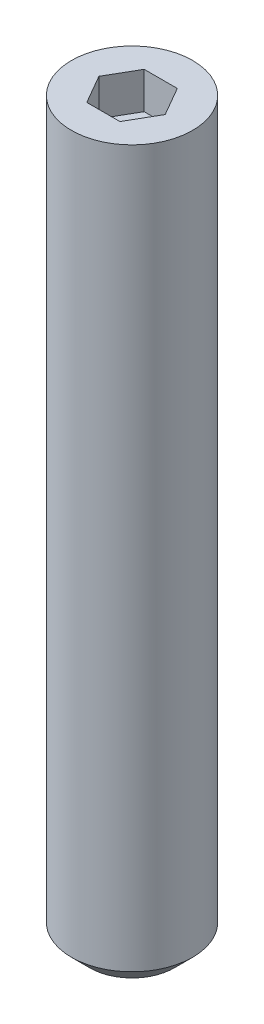
ISO-10303-21;
HEADER;
FILE_DESCRIPTION(('STEP AP214'),'2;1');
FILE_NAME('part.step','',(''),(''),'','','');
FILE_SCHEMA(('AUTOMOTIVE_DESIGN { 1 0 10303 214 1 1 1 1 }'));
ENDSEC;
DATA;
#1=APPLICATION_CONTEXT('core data for automotive mechanical design processes');
#2=APPLICATION_PROTOCOL_DEFINITION('international standard','automotive_design',2000,#1);
#3=PRODUCT_CONTEXT('',#1,'mechanical');
#4=PRODUCT('Part','Part','',(#3));
#5=PRODUCT_RELATED_PRODUCT_CATEGORY('part','',(#4));
#6=PRODUCT_DEFINITION_FORMATION('','',#4);
#7=PRODUCT_DEFINITION_CONTEXT('part definition',#1,'design');
#8=PRODUCT_DEFINITION('design','',#6,#7);
#9=PRODUCT_DEFINITION_SHAPE('','',#8);
#10=(LENGTH_UNIT() NAMED_UNIT(*) SI_UNIT(.MILLI.,.METRE.));
#11=(NAMED_UNIT(*) PLANE_ANGLE_UNIT() SI_UNIT($,.RADIAN.));
#12=(NAMED_UNIT(*) SI_UNIT($,.STERADIAN.) SOLID_ANGLE_UNIT());
#13=UNCERTAINTY_MEASURE_WITH_UNIT(LENGTH_MEASURE(1.E-05),#10,'distance_accuracy_value','');
#14=(GEOMETRIC_REPRESENTATION_CONTEXT(3) GLOBAL_UNCERTAINTY_ASSIGNED_CONTEXT((#13)) GLOBAL_UNIT_ASSIGNED_CONTEXT((#10,
#11,#12)) REPRESENTATION_CONTEXT('',''));
#15=CARTESIAN_POINT('',(0.,0.,0.));
#16=DIRECTION('',(0.,0.,1.));
#17=DIRECTION('',(1.,0.,0.));
#18=AXIS2_PLACEMENT_3D('',#15,#16,#17);
#19=CARTESIAN_POINT('',(-1.14567944042316,11.43,0.));
#20=DIRECTION('',(0.,1.,0.));
#21=DIRECTION('',(0.,0.,1.));
#22=AXIS2_PLACEMENT_3D('',#19,#20,#21);
#23=PLANE('',#22);
#24=DIRECTION('',(-0.5,0.,-0.866025403784438));
#25=VECTOR('',#24,1.);
#26=CARTESIAN_POINT('',(1.14567944042316,11.43,0.));
#27=LINE('',#26,#25);
#28=CARTESIAN_POINT('',(1.14567944042316,11.43,0.));
#29=VERTEX_POINT('',#28);
#30=CARTESIAN_POINT('',(0.572839720211582,11.43,-0.992187499999999));
#31=VERTEX_POINT('',#30);
#32=EDGE_CURVE('E67',#29,#31,#27,.T.);
#33=ORIENTED_EDGE('',*,*,#32,.T.);
#34=DIRECTION('',(-1.,0.,0.));
#35=VECTOR('',#34,1.);
#36=CARTESIAN_POINT('',(0.572839720211582,11.43,-0.992187499999999));
#37=LINE('',#36,#35);
#38=CARTESIAN_POINT('',(-0.572839720211583,11.43,-0.992187499999999));
#39=VERTEX_POINT('',#38);
#40=EDGE_CURVE('E69',#31,#39,#37,.T.);
#41=ORIENTED_EDGE('',*,*,#40,.T.);
#42=DIRECTION('',(-0.5,0.,0.866025403784439));
#43=VECTOR('',#42,1.);
#44=CARTESIAN_POINT('',(-0.572839720211583,11.43,-0.992187499999999));
#45=LINE('',#44,#43);
#46=CARTESIAN_POINT('',(-1.14567944042316,11.43,0.));
#47=VERTEX_POINT('',#46);
#48=EDGE_CURVE('E71',#39,#47,#45,.T.);
#49=ORIENTED_EDGE('',*,*,#48,.T.);
#50=DIRECTION('',(0.500000000000001,0.,0.866025403784438));
#51=VECTOR('',#50,1.);
#52=CARTESIAN_POINT('',(-1.14567944042316,11.43,0.));
#53=LINE('',#52,#51);
#54=CARTESIAN_POINT('',(-0.572839720211581,11.43,0.9921875));
#55=VERTEX_POINT('',#54);
#56=EDGE_CURVE('E117',#47,#55,#53,.T.);
#57=ORIENTED_EDGE('',*,*,#56,.T.);
#58=DIRECTION('',(1.,0.,0.));
#59=VECTOR('',#58,1.);
#60=CARTESIAN_POINT('',(-0.572839720211581,11.43,0.9921875));
#61=LINE('',#60,#59);
#62=CARTESIAN_POINT('',(0.572839720211582,11.43,0.9921875));
#63=VERTEX_POINT('',#62);
#64=EDGE_CURVE('E122',#55,#63,#61,.T.);
#65=ORIENTED_EDGE('',*,*,#64,.T.);
#66=DIRECTION('',(0.5,0.,-0.866025403784439));
#67=VECTOR('',#66,1.);
#68=CARTESIAN_POINT('',(0.572839720211582,11.43,0.9921875));
#69=LINE('',#68,#67);
#70=EDGE_CURVE('E126',#63,#29,#69,.T.);
#71=ORIENTED_EDGE('',*,*,#70,.T.);
#72=EDGE_LOOP('',(#33,#41,#49,#57,#65,#71));
#73=FACE_BOUND('',#72,.T.);
#74=ADVANCED_FACE('F16',(#73),#23,.T.);
#75=CARTESIAN_POINT('',(-0.572839720211583,11.43,-0.992187499999999));
#76=DIRECTION('',(-0.866025403784439,0.,-0.5));
#77=DIRECTION('',(-0.5,0.,0.866025403784439));
#78=AXIS2_PLACEMENT_3D('',#75,#76,#77);
#79=PLANE('',#78);
#80=DIRECTION('',(0.,1.,0.));
#81=VECTOR('',#80,1.);
#82=CARTESIAN_POINT('',(-1.14567944042316,11.43,0.));
#83=LINE('',#82,#81);
#84=CARTESIAN_POINT('',(-1.14567944042316,12.7,0.));
#85=VERTEX_POINT('',#84);
#86=EDGE_CURVE('E82',#85,#47,#83,.F.);
#87=ORIENTED_EDGE('',*,*,#86,.T.);
#88=ORIENTED_EDGE('',*,*,#48,.F.);
#89=DIRECTION('',(0.,1.,0.));
#90=VECTOR('',#89,1.);
#91=CARTESIAN_POINT('',(-0.572839720211583,11.43,-0.992187499999999));
#92=LINE('',#91,#90);
#93=CARTESIAN_POINT('',(-0.572839720211583,12.7,-0.992187499999999));
#94=VERTEX_POINT('',#93);
#95=EDGE_CURVE('E76',#39,#94,#92,.T.);
#96=ORIENTED_EDGE('',*,*,#95,.T.);
#97=DIRECTION('',(0.5,0.,-0.866025403784439));
#98=VECTOR('',#97,1.);
#99=CARTESIAN_POINT('',(-1.14567944042316,12.7,0.));
#100=LINE('',#99,#98);
#101=EDGE_CURVE('E114',#85,#94,#100,.T.);
#102=ORIENTED_EDGE('',*,*,#101,.F.);
#103=EDGE_LOOP('',(#87,#88,#96,#102));
#104=FACE_BOUND('',#103,.T.);
#105=ADVANCED_FACE('F79',(#104),#79,.F.);
#106=CARTESIAN_POINT('',(0.572839720211582,11.43,-0.992187499999999));
#107=DIRECTION('',(0.,0.,-1.));
#108=DIRECTION('',(-1.,0.,0.));
#109=AXIS2_PLACEMENT_3D('',#106,#107,#108);
#110=PLANE('',#109);
#111=ORIENTED_EDGE('',*,*,#95,.F.);
#112=ORIENTED_EDGE('',*,*,#40,.F.);
#113=DIRECTION('',(0.,1.,0.));
#114=VECTOR('',#113,1.);
#115=CARTESIAN_POINT('',(0.572839720211582,11.43,-0.992187499999999));
#116=LINE('',#115,#114);
#117=CARTESIAN_POINT('',(0.572839720211582,12.7,-0.992187499999999));
#118=VERTEX_POINT('',#117);
#119=EDGE_CURVE('E90',#31,#118,#116,.T.);
#120=ORIENTED_EDGE('',*,*,#119,.T.);
#121=DIRECTION('',(1.,0.,0.));
#122=VECTOR('',#121,1.);
#123=CARTESIAN_POINT('',(0.,12.7,-0.992187499999999));
#124=LINE('',#123,#122);
#125=EDGE_CURVE('E87',#94,#118,#124,.T.);
#126=ORIENTED_EDGE('',*,*,#125,.F.);
#127=EDGE_LOOP('',(#111,#112,#120,#126));
#128=FACE_BOUND('',#127,.T.);
#129=ADVANCED_FACE('F85',(#128),#110,.F.);
#130=CARTESIAN_POINT('',(1.14567944042316,11.43,0.));
#131=DIRECTION('',(0.866025403784438,0.,-0.5));
#132=DIRECTION('',(-0.5,0.,-0.866025403784438));
#133=AXIS2_PLACEMENT_3D('',#130,#131,#132);
#134=PLANE('',#133);
#135=ORIENTED_EDGE('',*,*,#119,.F.);
#136=ORIENTED_EDGE('',*,*,#32,.F.);
#137=DIRECTION('',(0.,1.,0.));
#138=VECTOR('',#137,1.);
#139=CARTESIAN_POINT('',(1.14567944042316,11.43,0.));
#140=LINE('',#139,#138);
#141=CARTESIAN_POINT('',(1.14567944042316,12.7,0.));
#142=VERTEX_POINT('',#141);
#143=EDGE_CURVE('E124',#29,#142,#140,.T.);
#144=ORIENTED_EDGE('',*,*,#143,.T.);
#145=DIRECTION('',(0.5,0.,0.866025403784438));
#146=VECTOR('',#145,1.);
#147=CARTESIAN_POINT('',(0.572839720211582,12.7,-0.992187499999999));
#148=LINE('',#147,#146);
#149=EDGE_CURVE('E110',#118,#142,#148,.T.);
#150=ORIENTED_EDGE('',*,*,#149,.F.);
#151=EDGE_LOOP('',(#135,#136,#144,#150));
#152=FACE_BOUND('',#151,.T.);
#153=ADVANCED_FACE('F129',(#152),#134,.F.);
#154=CARTESIAN_POINT('',(0.572839720211582,11.43,0.9921875));
#155=DIRECTION('',(0.866025403784439,0.,0.5));
#156=DIRECTION('',(0.5,0.,-0.866025403784439));
#157=AXIS2_PLACEMENT_3D('',#154,#155,#156);
#158=PLANE('',#157);
#159=ORIENTED_EDGE('',*,*,#143,.F.);
#160=ORIENTED_EDGE('',*,*,#70,.F.);
#161=DIRECTION('',(0.,1.,0.));
#162=VECTOR('',#161,1.);
#163=CARTESIAN_POINT('',(0.572839720211582,11.43,0.9921875));
#164=LINE('',#163,#162);
#165=CARTESIAN_POINT('',(0.572839720211582,12.7,0.9921875));
#166=VERTEX_POINT('',#165);
#167=EDGE_CURVE('E120',#63,#166,#164,.T.);
#168=ORIENTED_EDGE('',*,*,#167,.T.);
#169=DIRECTION('',(-0.5,0.,0.866025403784438));
#170=VECTOR('',#169,1.);
#171=CARTESIAN_POINT('',(1.14567944042316,12.7,0.));
#172=LINE('',#171,#170);
#173=EDGE_CURVE('E105',#142,#166,#172,.T.);
#174=ORIENTED_EDGE('',*,*,#173,.F.);
#175=EDGE_LOOP('',(#159,#160,#168,#174));
#176=FACE_BOUND('',#175,.T.);
#177=ADVANCED_FACE('F139',(#176),#158,.F.);
#178=CARTESIAN_POINT('',(-0.572839720211581,11.43,0.9921875));
#179=DIRECTION('',(0.,0.,1.));
#180=DIRECTION('',(1.,0.,0.));
#181=AXIS2_PLACEMENT_3D('',#178,#179,#180);
#182=PLANE('',#181);
#183=ORIENTED_EDGE('',*,*,#167,.F.);
#184=ORIENTED_EDGE('',*,*,#64,.F.);
#185=DIRECTION('',(0.,1.,0.));
#186=VECTOR('',#185,1.);
#187=CARTESIAN_POINT('',(-0.572839720211581,11.43,0.9921875));
#188=LINE('',#187,#186);
#189=CARTESIAN_POINT('',(-0.572839720211581,12.7,0.9921875));
#190=VERTEX_POINT('',#189);
#191=EDGE_CURVE('E34',#55,#190,#188,.T.);
#192=ORIENTED_EDGE('',*,*,#191,.T.);
#193=DIRECTION('',(1.,0.,0.));
#194=VECTOR('',#193,1.);
#195=CARTESIAN_POINT('',(0.,12.7,0.9921875));
#196=LINE('',#195,#194);
#197=EDGE_CURVE('E101',#166,#190,#196,.F.);
#198=ORIENTED_EDGE('',*,*,#197,.F.);
#199=EDGE_LOOP('',(#183,#184,#192,#198));
#200=FACE_BOUND('',#199,.T.);
#201=ADVANCED_FACE('F137',(#200),#182,.F.);
#202=CARTESIAN_POINT('',(-1.14567944042316,11.43,0.));
#203=DIRECTION('',(-0.866025403784438,0.,0.500000000000001));
#204=DIRECTION('',(0.500000000000001,0.,0.866025403784438));
#205=AXIS2_PLACEMENT_3D('',#202,#203,#204);
#206=PLANE('',#205);
#207=ORIENTED_EDGE('',*,*,#191,.F.);
#208=ORIENTED_EDGE('',*,*,#56,.F.);
#209=ORIENTED_EDGE('',*,*,#86,.F.);
#210=DIRECTION('',(-0.5,0.,-0.866025403784438));
#211=VECTOR('',#210,1.);
#212=CARTESIAN_POINT('',(-0.572839720211581,12.7,0.9921875));
#213=LINE('',#212,#211);
#214=EDGE_CURVE('E97',#190,#85,#213,.T.);
#215=ORIENTED_EDGE('',*,*,#214,.F.);
#216=EDGE_LOOP('',(#207,#208,#209,#215));
#217=FACE_BOUND('',#216,.T.);
#218=ADVANCED_FACE('F134',(#217),#206,.F.);
#219=CARTESIAN_POINT('',(0.,-12.7,0.));
#220=DIRECTION('',(0.,1.,0.));
#221=DIRECTION('',(0.,0.,1.));
#222=AXIS2_PLACEMENT_3D('',#219,#220,#221);
#223=PLANE('',#222);
#224=CARTESIAN_POINT('',(0.,-12.7000000000521,0.));
#225=DIRECTION('',(0.,1.,0.));
#226=DIRECTION('',(0.,0.,1.));
#227=AXIS2_PLACEMENT_3D('',#224,#225,#226);
#228=CIRCLE('',#227,1.46049999995057);
#229=CARTESIAN_POINT('',(0.,-12.7000000000521,1.46049999995057));
#230=VERTEX_POINT('',#229);
#231=EDGE_CURVE('E19',#230,#230,#228,.T.);
#232=ORIENTED_EDGE('',*,*,#231,.F.);
#233=EDGE_LOOP('',(#232));
#234=FACE_BOUND('',#233,.T.);
#235=ADVANCED_FACE('F162',(#234),#223,.F.);
#236=CARTESIAN_POINT('',(0.,12.7,0.));
#237=DIRECTION('',(0.,1.,0.));
#238=DIRECTION('',(0.,0.,1.));
#239=AXIS2_PLACEMENT_3D('',#236,#237,#238);
#240=PLANE('',#239);
#241=CARTESIAN_POINT('',(0.,12.7,0.));
#242=DIRECTION('',(0.,-1.,0.));
#243=DIRECTION('',(0.,0.,-1.));
#244=AXIS2_PLACEMENT_3D('',#241,#242,#243);
#245=CIRCLE('',#244,2.0955);
#246=CARTESIAN_POINT('',(0.,12.7,-2.0955));
#247=VERTEX_POINT('',#246);
#248=EDGE_CURVE('E25',#247,#247,#245,.T.);
#249=ORIENTED_EDGE('',*,*,#248,.F.);
#250=EDGE_LOOP('',(#249));
#251=FACE_BOUND('',#250,.T.);
#252=ORIENTED_EDGE('',*,*,#197,.T.);
#253=ORIENTED_EDGE('',*,*,#214,.T.);
#254=ORIENTED_EDGE('',*,*,#101,.T.);
#255=ORIENTED_EDGE('',*,*,#125,.T.);
#256=ORIENTED_EDGE('',*,*,#149,.T.);
#257=ORIENTED_EDGE('',*,*,#173,.T.);
#258=EDGE_LOOP('',(#252,#253,#254,#255,#256,#257));
#259=FACE_BOUND('',#258,.T.);
#260=ADVANCED_FACE('F132',(#251,#259),#240,.T.);
#261=CARTESIAN_POINT('',(0.,-12.0650000000637,0.));
#262=DIRECTION('',(0.,1.,0.));
#263=DIRECTION('',(0.,0.,1.));
#264=AXIS2_PLACEMENT_3D('',#261,#262,#263);
#265=CONICAL_SURFACE('',#264,2.09549999993897,0.785398163397448);
#266=CARTESIAN_POINT('',(0.,-12.065,0.));
#267=DIRECTION('',(0.,-1.,0.));
#268=DIRECTION('',(0.,0.,-1.));
#269=AXIS2_PLACEMENT_3D('',#266,#267,#268);
#270=CIRCLE('',#269,2.0955);
#271=CARTESIAN_POINT('',(0.,-12.065,-2.0955));
#272=VERTEX_POINT('',#271);
#273=EDGE_CURVE('E10',#272,#272,#270,.F.);
#274=ORIENTED_EDGE('',*,*,#273,.F.);
#275=EDGE_LOOP('',(#274));
#276=FACE_BOUND('',#275,.T.);
#277=ORIENTED_EDGE('',*,*,#231,.T.);
#278=EDGE_LOOP('',(#277));
#279=FACE_BOUND('',#278,.T.);
#280=ADVANCED_FACE('F151',(#276,#279),#265,.T.);
#281=CARTESIAN_POINT('',(0.,12.7,0.));
#282=DIRECTION('',(0.,-1.,0.));
#283=DIRECTION('',(0.,0.,-1.));
#284=AXIS2_PLACEMENT_3D('',#281,#282,#283);
#285=CYLINDRICAL_SURFACE('',#284,2.0955);
#286=ORIENTED_EDGE('',*,*,#248,.T.);
#287=EDGE_LOOP('',(#286));
#288=FACE_BOUND('',#287,.T.);
#289=ORIENTED_EDGE('',*,*,#273,.T.);
#290=EDGE_LOOP('',(#289));
#291=FACE_BOUND('',#290,.T.);
#292=ADVANCED_FACE('F149',(#288,#291),#285,.T.);
#293=CLOSED_SHELL('',(#74,#105,#129,#153,#177,#201,#218,#235,#260,#280,#292));
#294=MANIFOLD_SOLID_BREP('B1',#293);
#295=ADVANCED_BREP_SHAPE_REPRESENTATION('',(#18,#294),#14);
#296=SHAPE_DEFINITION_REPRESENTATION(#9,#295);
ENDSEC;
END-ISO-10303-21;
